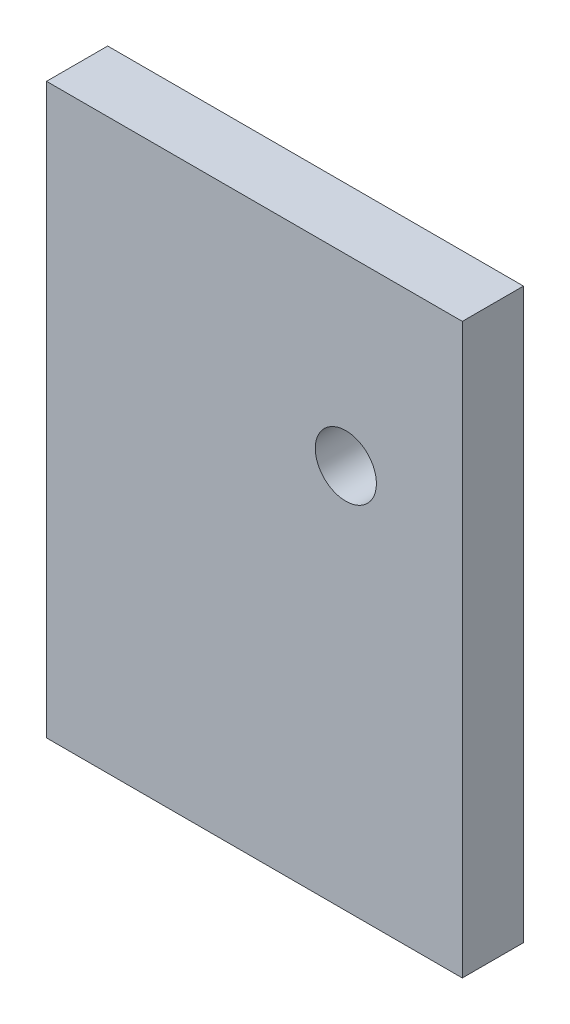
ISO-10303-21;
HEADER;
FILE_DESCRIPTION(('STEP AP214'),'2;1');
FILE_NAME('part.step','',(''),(''),'','','');
FILE_SCHEMA(('AUTOMOTIVE_DESIGN { 1 0 10303 214 1 1 1 1 }'));
ENDSEC;
DATA;
#1=APPLICATION_CONTEXT('core data for automotive mechanical design processes');
#2=APPLICATION_PROTOCOL_DEFINITION('international standard','automotive_design',2000,#1);
#3=PRODUCT_CONTEXT('',#1,'mechanical');
#4=PRODUCT('Part','Part','',(#3));
#5=PRODUCT_RELATED_PRODUCT_CATEGORY('part','',(#4));
#6=PRODUCT_DEFINITION_FORMATION('','',#4);
#7=PRODUCT_DEFINITION_CONTEXT('part definition',#1,'design');
#8=PRODUCT_DEFINITION('design','',#6,#7);
#9=PRODUCT_DEFINITION_SHAPE('','',#8);
#10=(LENGTH_UNIT() NAMED_UNIT(*) SI_UNIT(.MILLI.,.METRE.));
#11=(NAMED_UNIT(*) PLANE_ANGLE_UNIT() SI_UNIT($,.RADIAN.));
#12=(NAMED_UNIT(*) SI_UNIT($,.STERADIAN.) SOLID_ANGLE_UNIT());
#13=UNCERTAINTY_MEASURE_WITH_UNIT(LENGTH_MEASURE(1.E-05),#10,'distance_accuracy_value','');
#14=(GEOMETRIC_REPRESENTATION_CONTEXT(3) GLOBAL_UNCERTAINTY_ASSIGNED_CONTEXT((#13)) GLOBAL_UNIT_ASSIGNED_CONTEXT((#10,
#11,#12)) REPRESENTATION_CONTEXT('',''));
#15=CARTESIAN_POINT('',(0.,0.,0.));
#16=DIRECTION('',(0.,0.,1.));
#17=DIRECTION('',(1.,0.,0.));
#18=AXIS2_PLACEMENT_3D('',#15,#16,#17);
#19=CARTESIAN_POINT('',(-54.8277353652689,48.1512235817575,10.));
#20=DIRECTION('',(1.,0.,0.));
#21=DIRECTION('',(0.,1.,0.));
#22=AXIS2_PLACEMENT_3D('',#19,#20,#21);
#23=PLANE('',#22);
#24=DIRECTION('',(0.,-1.,0.));
#25=VECTOR('',#24,1.);
#26=CARTESIAN_POINT('',(-54.8277353652689,48.1512235817575,0.));
#27=LINE('',#26,#25);
#28=CARTESIAN_POINT('',(-54.8277353652689,48.1512235817575,0.));
#29=VERTEX_POINT('',#28);
#30=CARTESIAN_POINT('',(-54.8277353652689,-44.8487764182425,0.));
#31=VERTEX_POINT('',#30);
#32=EDGE_CURVE('E107',#29,#31,#27,.T.);
#33=ORIENTED_EDGE('',*,*,#32,.T.);
#34=DIRECTION('',(0.,0.,-1.));
#35=VECTOR('',#34,1.);
#36=CARTESIAN_POINT('',(-54.8277353652689,-44.8487764182425,10.));
#37=LINE('',#36,#35);
#38=CARTESIAN_POINT('',(-54.8277353652689,-44.8487764182425,10.));
#39=VERTEX_POINT('',#38);
#40=EDGE_CURVE('E11',#39,#31,#37,.T.);
#41=ORIENTED_EDGE('',*,*,#40,.F.);
#42=DIRECTION('',(0.,-1.,0.));
#43=VECTOR('',#42,1.);
#44=CARTESIAN_POINT('',(-54.8277353652689,48.1512235817575,10.));
#45=LINE('',#44,#43);
#46=CARTESIAN_POINT('',(-54.8277353652689,48.1512235817575,10.));
#47=VERTEX_POINT('',#46);
#48=EDGE_CURVE('E91',#47,#39,#45,.T.);
#49=ORIENTED_EDGE('',*,*,#48,.F.);
#50=DIRECTION('',(0.,0.,-1.));
#51=VECTOR('',#50,1.);
#52=CARTESIAN_POINT('',(-54.8277353652689,48.1512235817575,10.));
#53=LINE('',#52,#51);
#54=EDGE_CURVE('E103',#47,#29,#53,.T.);
#55=ORIENTED_EDGE('',*,*,#54,.T.);
#56=EDGE_LOOP('',(#33,#41,#49,#55));
#57=FACE_BOUND('',#56,.T.);
#58=ADVANCED_FACE('F39',(#57),#23,.F.);
#59=CARTESIAN_POINT('',(-54.8277353652689,-44.8487764182425,10.));
#60=DIRECTION('',(0.,1.,0.));
#61=DIRECTION('',(0.,0.,1.));
#62=AXIS2_PLACEMENT_3D('',#59,#60,#61);
#63=PLANE('',#62);
#64=DIRECTION('',(1.,0.,0.));
#65=VECTOR('',#64,1.);
#66=CARTESIAN_POINT('',(-54.8277353652689,-44.8487764182425,0.));
#67=LINE('',#66,#65);
#68=CARTESIAN_POINT('',(13.1722646347311,-44.8487764182425,0.));
#69=VERTEX_POINT('',#68);
#70=EDGE_CURVE('E96',#31,#69,#67,.T.);
#71=ORIENTED_EDGE('',*,*,#70,.T.);
#72=DIRECTION('',(0.,0.,-1.));
#73=VECTOR('',#72,1.);
#74=CARTESIAN_POINT('',(13.1722646347311,-44.8487764182425,10.));
#75=LINE('',#74,#73);
#76=CARTESIAN_POINT('',(13.1722646347311,-44.8487764182425,10.));
#77=VERTEX_POINT('',#76);
#78=EDGE_CURVE('E48',#77,#69,#75,.T.);
#79=ORIENTED_EDGE('',*,*,#78,.F.);
#80=DIRECTION('',(1.,0.,0.));
#81=VECTOR('',#80,1.);
#82=CARTESIAN_POINT('',(-54.8277353652689,-44.8487764182425,10.));
#83=LINE('',#82,#81);
#84=EDGE_CURVE('E86',#39,#77,#83,.T.);
#85=ORIENTED_EDGE('',*,*,#84,.F.);
#86=ORIENTED_EDGE('',*,*,#40,.T.);
#87=EDGE_LOOP('',(#71,#79,#85,#86));
#88=FACE_BOUND('',#87,.T.);
#89=ADVANCED_FACE('F95',(#88),#63,.F.);
#90=CARTESIAN_POINT('',(13.1722646347311,48.1512235817575,10.));
#91=DIRECTION('',(-1.,0.,0.));
#92=DIRECTION('',(0.,-1.,0.));
#93=AXIS2_PLACEMENT_3D('',#90,#91,#92);
#94=PLANE('',#93);
#95=DIRECTION('',(0.,1.,0.));
#96=VECTOR('',#95,1.);
#97=CARTESIAN_POINT('',(13.1722646347311,48.1512235817575,0.));
#98=LINE('',#97,#96);
#99=CARTESIAN_POINT('',(13.1722646347311,48.1512235817575,0.));
#100=VERTEX_POINT('',#99);
#101=EDGE_CURVE('E73',#69,#100,#98,.T.);
#102=ORIENTED_EDGE('',*,*,#101,.T.);
#103=DIRECTION('',(0.,0.,-1.));
#104=VECTOR('',#103,1.);
#105=CARTESIAN_POINT('',(13.1722646347311,48.1512235817575,10.));
#106=LINE('',#105,#104);
#107=CARTESIAN_POINT('',(13.1722646347311,48.1512235817575,10.));
#108=VERTEX_POINT('',#107);
#109=EDGE_CURVE('E98',#108,#100,#106,.T.);
#110=ORIENTED_EDGE('',*,*,#109,.F.);
#111=DIRECTION('',(0.,1.,0.));
#112=VECTOR('',#111,1.);
#113=CARTESIAN_POINT('',(13.1722646347311,48.1512235817575,10.));
#114=LINE('',#113,#112);
#115=EDGE_CURVE('E89',#77,#108,#114,.T.);
#116=ORIENTED_EDGE('',*,*,#115,.F.);
#117=ORIENTED_EDGE('',*,*,#78,.T.);
#118=EDGE_LOOP('',(#102,#110,#116,#117));
#119=FACE_BOUND('',#118,.T.);
#120=ADVANCED_FACE('F99',(#119),#94,.F.);
#121=CARTESIAN_POINT('',(-54.8277353652689,48.1512235817575,10.));
#122=DIRECTION('',(0.,-1.,0.));
#123=DIRECTION('',(0.,0.,-1.));
#124=AXIS2_PLACEMENT_3D('',#121,#122,#123);
#125=PLANE('',#124);
#126=DIRECTION('',(-1.,0.,0.));
#127=VECTOR('',#126,1.);
#128=CARTESIAN_POINT('',(-54.8277353652689,48.1512235817575,0.));
#129=LINE('',#128,#127);
#130=EDGE_CURVE('E79',#100,#29,#129,.T.);
#131=ORIENTED_EDGE('',*,*,#130,.T.);
#132=ORIENTED_EDGE('',*,*,#54,.F.);
#133=DIRECTION('',(-1.,0.,0.));
#134=VECTOR('',#133,1.);
#135=CARTESIAN_POINT('',(-54.8277353652689,48.1512235817575,10.));
#136=LINE('',#135,#134);
#137=EDGE_CURVE('E56',#108,#47,#136,.T.);
#138=ORIENTED_EDGE('',*,*,#137,.F.);
#139=ORIENTED_EDGE('',*,*,#109,.T.);
#140=EDGE_LOOP('',(#131,#132,#138,#139));
#141=FACE_BOUND('',#140,.T.);
#142=ADVANCED_FACE('F121',(#141),#125,.F.);
#143=CARTESIAN_POINT('',(0.,0.,10.));
#144=DIRECTION('',(0.,0.,1.));
#145=DIRECTION('',(1.,0.,0.));
#146=AXIS2_PLACEMENT_3D('',#143,#144,#145);
#147=PLANE('',#146);
#148=CARTESIAN_POINT('',(-5.87773536526891,18.1512235817575,10.));
#149=DIRECTION('',(0.,0.,1.));
#150=DIRECTION('',(1.,0.,0.));
#151=AXIS2_PLACEMENT_3D('',#148,#149,#150);
#152=CIRCLE('',#151,5.);
#153=CARTESIAN_POINT('',(-0.877735365268916,18.1512235817575,10.));
#154=VERTEX_POINT('',#153);
#155=EDGE_CURVE('E128',#154,#154,#152,.T.);
#156=ORIENTED_EDGE('',*,*,#155,.F.);
#157=EDGE_LOOP('',(#156));
#158=FACE_BOUND('',#157,.T.);
#159=ORIENTED_EDGE('',*,*,#48,.T.);
#160=ORIENTED_EDGE('',*,*,#84,.T.);
#161=ORIENTED_EDGE('',*,*,#115,.T.);
#162=ORIENTED_EDGE('',*,*,#137,.T.);
#163=EDGE_LOOP('',(#159,#160,#161,#162));
#164=FACE_BOUND('',#163,.T.);
#165=ADVANCED_FACE('F87',(#158,#164),#147,.T.);
#166=CARTESIAN_POINT('',(0.,0.,0.));
#167=DIRECTION('',(0.,0.,1.));
#168=DIRECTION('',(1.,0.,0.));
#169=AXIS2_PLACEMENT_3D('',#166,#167,#168);
#170=PLANE('',#169);
#171=CARTESIAN_POINT('',(-5.87773536526891,18.1512235817575,0.));
#172=DIRECTION('',(0.,0.,1.));
#173=DIRECTION('',(1.,0.,0.));
#174=AXIS2_PLACEMENT_3D('',#171,#172,#173);
#175=CIRCLE('',#174,5.);
#176=CARTESIAN_POINT('',(-0.877735365268916,18.1512235817575,0.));
#177=VERTEX_POINT('',#176);
#178=EDGE_CURVE('E111',#177,#177,#175,.T.);
#179=ORIENTED_EDGE('',*,*,#178,.T.);
#180=EDGE_LOOP('',(#179));
#181=FACE_BOUND('',#180,.T.);
#182=ORIENTED_EDGE('',*,*,#32,.F.);
#183=ORIENTED_EDGE('',*,*,#130,.F.);
#184=ORIENTED_EDGE('',*,*,#101,.F.);
#185=ORIENTED_EDGE('',*,*,#70,.F.);
#186=EDGE_LOOP('',(#182,#183,#184,#185));
#187=FACE_BOUND('',#186,.T.);
#188=ADVANCED_FACE('F124',(#181,#187),#170,.F.);
#189=CARTESIAN_POINT('',(-5.87773536526891,18.1512235817575,0.));
#190=DIRECTION('',(0.,0.,1.));
#191=DIRECTION('',(1.,0.,0.));
#192=AXIS2_PLACEMENT_3D('',#189,#190,#191);
#193=CYLINDRICAL_SURFACE('',#192,5.);
#194=ORIENTED_EDGE('',*,*,#178,.F.);
#195=EDGE_LOOP('',(#194));
#196=FACE_BOUND('',#195,.T.);
#197=ORIENTED_EDGE('',*,*,#155,.T.);
#198=EDGE_LOOP('',(#197));
#199=FACE_BOUND('',#198,.T.);
#200=ADVANCED_FACE('F137',(#196,#199),#193,.F.);
#201=CLOSED_SHELL('',(#58,#89,#120,#142,#165,#188,#200));
#202=MANIFOLD_SOLID_BREP('B2',#201);
#203=ADVANCED_BREP_SHAPE_REPRESENTATION('',(#18,#202),#14);
#204=SHAPE_DEFINITION_REPRESENTATION(#9,#203);
ENDSEC;
END-ISO-10303-21;
